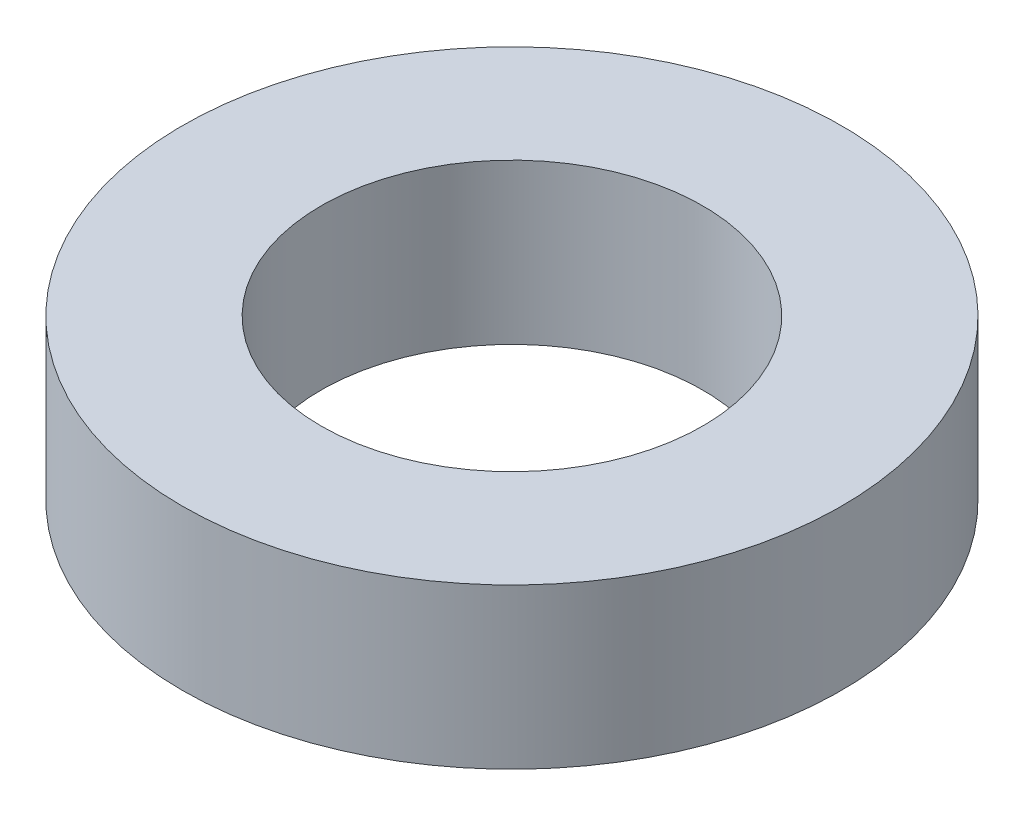
ISO-10303-21;
HEADER;
FILE_DESCRIPTION(('STEP AP214'),'2;1');
FILE_NAME('part.step','',(''),(''),'','','');
FILE_SCHEMA(('AUTOMOTIVE_DESIGN { 1 0 10303 214 1 1 1 1 }'));
ENDSEC;
DATA;
#1=APPLICATION_CONTEXT('core data for automotive mechanical design processes');
#2=APPLICATION_PROTOCOL_DEFINITION('international standard','automotive_design',2000,#1);
#3=PRODUCT_CONTEXT('',#1,'mechanical');
#4=PRODUCT('Part','Part','',(#3));
#5=PRODUCT_RELATED_PRODUCT_CATEGORY('part','',(#4));
#6=PRODUCT_DEFINITION_FORMATION('','',#4);
#7=PRODUCT_DEFINITION_CONTEXT('part definition',#1,'design');
#8=PRODUCT_DEFINITION('design','',#6,#7);
#9=PRODUCT_DEFINITION_SHAPE('','',#8);
#10=(LENGTH_UNIT() NAMED_UNIT(*) SI_UNIT(.MILLI.,.METRE.));
#11=(NAMED_UNIT(*) PLANE_ANGLE_UNIT() SI_UNIT($,.RADIAN.));
#12=(NAMED_UNIT(*) SI_UNIT($,.STERADIAN.) SOLID_ANGLE_UNIT());
#13=UNCERTAINTY_MEASURE_WITH_UNIT(LENGTH_MEASURE(1.E-05),#10,'distance_accuracy_value','');
#14=(GEOMETRIC_REPRESENTATION_CONTEXT(3) GLOBAL_UNCERTAINTY_ASSIGNED_CONTEXT((#13)) GLOBAL_UNIT_ASSIGNED_CONTEXT((#10,
#11,#12)) REPRESENTATION_CONTEXT('',''));
#15=CARTESIAN_POINT('',(0.,0.,0.));
#16=DIRECTION('',(0.,0.,1.));
#17=DIRECTION('',(1.,0.,0.));
#18=AXIS2_PLACEMENT_3D('',#15,#16,#17);
#19=CARTESIAN_POINT('',(0.,23.,0.));
#20=DIRECTION('',(0.,-1.,0.));
#21=DIRECTION('',(0.,0.,-1.));
#22=AXIS2_PLACEMENT_3D('',#19,#20,#21);
#23=CYLINDRICAL_SURFACE('',#22,47.5);
#24=CARTESIAN_POINT('',(0.,23.,0.));
#25=DIRECTION('',(0.,1.,0.));
#26=DIRECTION('',(0.,0.,1.));
#27=AXIS2_PLACEMENT_3D('',#24,#25,#26);
#28=CIRCLE('',#27,47.5);
#29=CARTESIAN_POINT('',(0.,23.,47.5));
#30=VERTEX_POINT('',#29);
#31=EDGE_CURVE('E10',#30,#30,#28,.T.);
#32=ORIENTED_EDGE('',*,*,#31,.F.);
#33=EDGE_LOOP('',(#32));
#34=FACE_BOUND('',#33,.T.);
#35=CARTESIAN_POINT('',(0.,0.,0.));
#36=DIRECTION('',(0.,1.,0.));
#37=DIRECTION('',(0.,0.,1.));
#38=AXIS2_PLACEMENT_3D('',#35,#36,#37);
#39=CIRCLE('',#38,47.5);
#40=CARTESIAN_POINT('',(0.,0.,47.5));
#41=VERTEX_POINT('',#40);
#42=EDGE_CURVE('E37',#41,#41,#39,.T.);
#43=ORIENTED_EDGE('',*,*,#42,.T.);
#44=EDGE_LOOP('',(#43));
#45=FACE_BOUND('',#44,.T.);
#46=ADVANCED_FACE('F40',(#34,#45),#23,.T.);
#47=CARTESIAN_POINT('',(0.,23.,0.));
#48=DIRECTION('',(0.,1.,0.));
#49=DIRECTION('',(0.,0.,1.));
#50=AXIS2_PLACEMENT_3D('',#47,#48,#49);
#51=PLANE('',#50);
#52=CARTESIAN_POINT('',(0.,23.,0.));
#53=DIRECTION('',(0.,1.,0.));
#54=DIRECTION('',(0.,0.,1.));
#55=AXIS2_PLACEMENT_3D('',#52,#53,#54);
#56=CIRCLE('',#55,27.5);
#57=CARTESIAN_POINT('',(0.,23.,27.5));
#58=VERTEX_POINT('',#57);
#59=EDGE_CURVE('E50',#58,#58,#56,.T.);
#60=ORIENTED_EDGE('',*,*,#59,.F.);
#61=EDGE_LOOP('',(#60));
#62=FACE_BOUND('',#61,.T.);
#63=ORIENTED_EDGE('',*,*,#31,.T.);
#64=EDGE_LOOP('',(#63));
#65=FACE_BOUND('',#64,.T.);
#66=ADVANCED_FACE('F59',(#62,#65),#51,.T.);
#67=CARTESIAN_POINT('',(0.,0.,0.));
#68=DIRECTION('',(0.,1.,0.));
#69=DIRECTION('',(0.,0.,1.));
#70=AXIS2_PLACEMENT_3D('',#67,#68,#69);
#71=PLANE('',#70);
#72=CARTESIAN_POINT('',(0.,0.,0.));
#73=DIRECTION('',(0.,1.,0.));
#74=DIRECTION('',(0.,0.,1.));
#75=AXIS2_PLACEMENT_3D('',#72,#73,#74);
#76=CIRCLE('',#75,27.5);
#77=CARTESIAN_POINT('',(0.,0.,27.5));
#78=VERTEX_POINT('',#77);
#79=EDGE_CURVE('E47',#78,#78,#76,.T.);
#80=ORIENTED_EDGE('',*,*,#79,.T.);
#81=EDGE_LOOP('',(#80));
#82=FACE_BOUND('',#81,.T.);
#83=ORIENTED_EDGE('',*,*,#42,.F.);
#84=EDGE_LOOP('',(#83));
#85=FACE_BOUND('',#84,.T.);
#86=ADVANCED_FACE('F58',(#82,#85),#71,.F.);
#87=CARTESIAN_POINT('',(0.,23.,0.));
#88=DIRECTION('',(0.,-1.,0.));
#89=DIRECTION('',(0.,0.,-1.));
#90=AXIS2_PLACEMENT_3D('',#87,#88,#89);
#91=CYLINDRICAL_SURFACE('',#90,27.5);
#92=ORIENTED_EDGE('',*,*,#59,.T.);
#93=EDGE_LOOP('',(#92));
#94=FACE_BOUND('',#93,.T.);
#95=ORIENTED_EDGE('',*,*,#79,.F.);
#96=EDGE_LOOP('',(#95));
#97=FACE_BOUND('',#96,.T.);
#98=ADVANCED_FACE('F54',(#94,#97),#91,.F.);
#99=CLOSED_SHELL('',(#46,#66,#86,#98));
#100=MANIFOLD_SOLID_BREP('B2',#99);
#101=ADVANCED_BREP_SHAPE_REPRESENTATION('',(#18,#100),#14);
#102=SHAPE_DEFINITION_REPRESENTATION(#9,#101);
ENDSEC;
END-ISO-10303-21;
